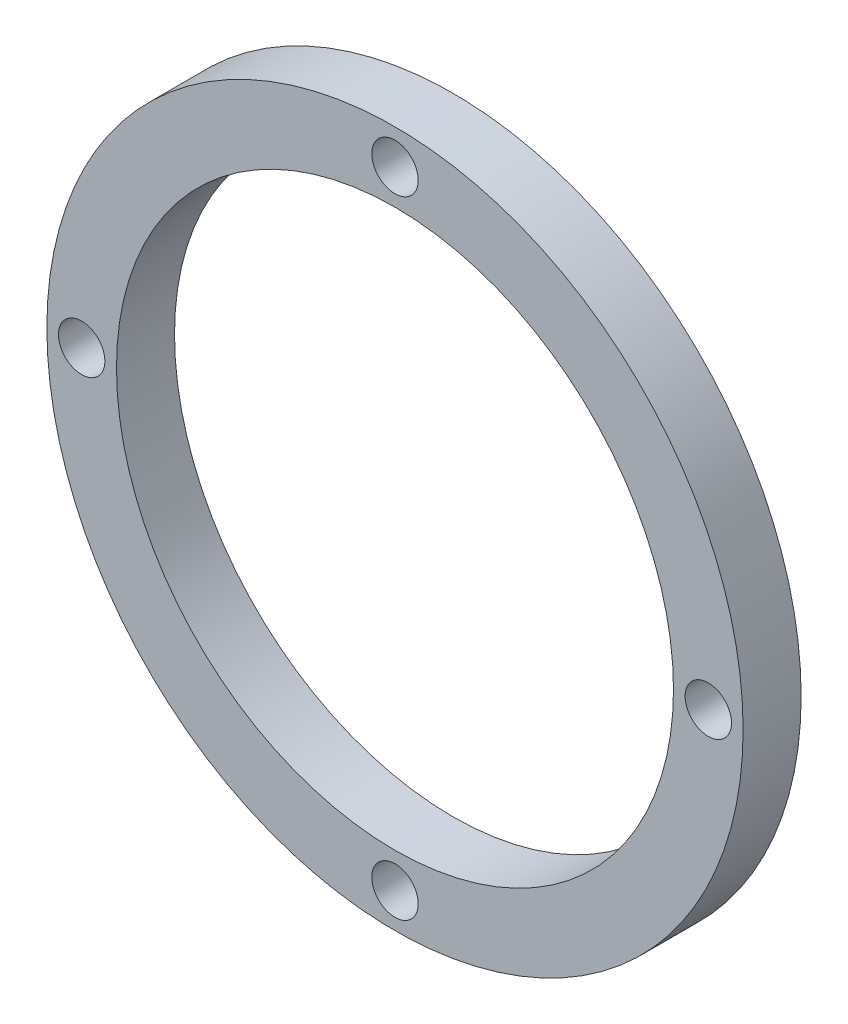
ISO-10303-21;
HEADER;
FILE_DESCRIPTION(('STEP AP214'),'2;1');
FILE_NAME('part.step','',(''),(''),'','','');
FILE_SCHEMA(('AUTOMOTIVE_DESIGN { 1 0 10303 214 1 1 1 1 }'));
ENDSEC;
DATA;
#1=APPLICATION_CONTEXT('core data for automotive mechanical design processes');
#2=APPLICATION_PROTOCOL_DEFINITION('international standard','automotive_design',2000,#1);
#3=PRODUCT_CONTEXT('',#1,'mechanical');
#4=PRODUCT('Part','Part','',(#3));
#5=PRODUCT_RELATED_PRODUCT_CATEGORY('part','',(#4));
#6=PRODUCT_DEFINITION_FORMATION('','',#4);
#7=PRODUCT_DEFINITION_CONTEXT('part definition',#1,'design');
#8=PRODUCT_DEFINITION('design','',#6,#7);
#9=PRODUCT_DEFINITION_SHAPE('','',#8);
#10=(LENGTH_UNIT() NAMED_UNIT(*) SI_UNIT(.MILLI.,.METRE.));
#11=(NAMED_UNIT(*) PLANE_ANGLE_UNIT() SI_UNIT($,.RADIAN.));
#12=(NAMED_UNIT(*) SI_UNIT($,.STERADIAN.) SOLID_ANGLE_UNIT());
#13=UNCERTAINTY_MEASURE_WITH_UNIT(LENGTH_MEASURE(1.E-05),#10,'distance_accuracy_value','');
#14=(GEOMETRIC_REPRESENTATION_CONTEXT(3) GLOBAL_UNCERTAINTY_ASSIGNED_CONTEXT((#13)) GLOBAL_UNIT_ASSIGNED_CONTEXT((#10,
#11,#12)) REPRESENTATION_CONTEXT('',''));
#15=CARTESIAN_POINT('',(0.,0.,0.));
#16=DIRECTION('',(0.,0.,1.));
#17=DIRECTION('',(1.,0.,0.));
#18=AXIS2_PLACEMENT_3D('',#15,#16,#17);
#19=CARTESIAN_POINT('',(0.,0.,0.));
#20=DIRECTION('',(0.,0.,1.));
#21=DIRECTION('',(1.,0.,0.));
#22=AXIS2_PLACEMENT_3D('',#19,#20,#21);
#23=PLANE('',#22);
#24=CARTESIAN_POINT('',(0.,0.,0.));
#25=DIRECTION('',(0.,0.,1.));
#26=DIRECTION('',(1.,0.,0.));
#27=AXIS2_PLACEMENT_3D('',#24,#25,#26);
#28=CIRCLE('',#27,15.);
#29=CARTESIAN_POINT('',(15.,0.,0.));
#30=VERTEX_POINT('',#29);
#31=EDGE_CURVE('E10',#30,#30,#28,.T.);
#32=ORIENTED_EDGE('',*,*,#31,.F.);
#33=EDGE_LOOP('',(#32));
#34=FACE_BOUND('',#33,.T.);
#35=CARTESIAN_POINT('',(0.,0.,0.));
#36=DIRECTION('',(0.,0.,1.));
#37=DIRECTION('',(1.,0.,0.));
#38=AXIS2_PLACEMENT_3D('',#35,#36,#37);
#39=CIRCLE('',#38,12.);
#40=CARTESIAN_POINT('',(12.,0.,0.));
#41=VERTEX_POINT('',#40);
#42=EDGE_CURVE('E38',#41,#41,#39,.T.);
#43=ORIENTED_EDGE('',*,*,#42,.T.);
#44=EDGE_LOOP('',(#43));
#45=FACE_BOUND('',#44,.T.);
#46=CARTESIAN_POINT('',(0.,13.5,0.));
#47=DIRECTION('',(0.,0.,1.));
#48=DIRECTION('',(1.,0.,0.));
#49=AXIS2_PLACEMENT_3D('',#46,#47,#48);
#50=CIRCLE('',#49,1.);
#51=CARTESIAN_POINT('',(1.,13.5,0.));
#52=VERTEX_POINT('',#51);
#53=EDGE_CURVE('E42',#52,#52,#50,.T.);
#54=ORIENTED_EDGE('',*,*,#53,.T.);
#55=EDGE_LOOP('',(#54));
#56=FACE_BOUND('',#55,.T.);
#57=CARTESIAN_POINT('',(13.5000000000004,3.81213167542181E-13,0.));
#58=DIRECTION('',(0.,0.,1.));
#59=DIRECTION('',(1.,0.,0.));
#60=AXIS2_PLACEMENT_3D('',#57,#58,#59);
#61=CIRCLE('',#60,1.0000000000003);
#62=CARTESIAN_POINT('',(14.5000000000007,3.81213167542181E-13,0.));
#63=VERTEX_POINT('',#62);
#64=EDGE_CURVE('E46',#63,#63,#61,.T.);
#65=ORIENTED_EDGE('',*,*,#64,.T.);
#66=EDGE_LOOP('',(#65));
#67=FACE_BOUND('',#66,.T.);
#68=CARTESIAN_POINT('',(7.62426335084362E-13,-13.5,0.));
#69=DIRECTION('',(0.,0.,1.));
#70=DIRECTION('',(1.,0.,0.));
#71=AXIS2_PLACEMENT_3D('',#68,#69,#70);
#72=CIRCLE('',#71,1.00000000000082);
#73=CARTESIAN_POINT('',(1.00000000000158,-13.5,0.));
#74=VERTEX_POINT('',#73);
#75=EDGE_CURVE('E51',#74,#74,#72,.T.);
#76=ORIENTED_EDGE('',*,*,#75,.T.);
#77=EDGE_LOOP('',(#76));
#78=FACE_BOUND('',#77,.T.);
#79=CARTESIAN_POINT('',(-13.4999999999996,-3.8286644072103E-13,0.));
#80=DIRECTION('',(0.,0.,1.));
#81=DIRECTION('',(1.,0.,0.));
#82=AXIS2_PLACEMENT_3D('',#79,#80,#81);
#83=CIRCLE('',#82,1.00000000000061);
#84=CARTESIAN_POINT('',(-12.499999999999,-3.8286644072103E-13,0.));
#85=VERTEX_POINT('',#84);
#86=EDGE_CURVE('E54',#85,#85,#83,.T.);
#87=ORIENTED_EDGE('',*,*,#86,.T.);
#88=EDGE_LOOP('',(#87));
#89=FACE_BOUND('',#88,.T.);
#90=ADVANCED_FACE('F31',(#34,#45,#56,#67,#78,#89),#23,.F.);
#91=CARTESIAN_POINT('',(0.,0.,1.));
#92=DIRECTION('',(0.,0.,-1.));
#93=DIRECTION('',(-1.,0.,0.));
#94=AXIS2_PLACEMENT_3D('',#91,#92,#93);
#95=CYLINDRICAL_SURFACE('',#94,15.);
#96=ORIENTED_EDGE('',*,*,#31,.T.);
#97=EDGE_LOOP('',(#96));
#98=FACE_BOUND('',#97,.T.);
#99=CARTESIAN_POINT('',(0.,0.,2.5));
#100=DIRECTION('',(0.,0.,1.));
#101=DIRECTION('',(1.,0.,0.));
#102=AXIS2_PLACEMENT_3D('',#99,#100,#101);
#103=CIRCLE('',#102,15.);
#104=CARTESIAN_POINT('',(15.,0.,2.5));
#105=VERTEX_POINT('',#104);
#106=EDGE_CURVE('E57',#105,#105,#103,.T.);
#107=ORIENTED_EDGE('',*,*,#106,.F.);
#108=EDGE_LOOP('',(#107));
#109=FACE_BOUND('',#108,.T.);
#110=ADVANCED_FACE('F33',(#98,#109),#95,.T.);
#111=CARTESIAN_POINT('',(0.,0.,1.));
#112=DIRECTION('',(0.,0.,-1.));
#113=DIRECTION('',(-1.,0.,0.));
#114=AXIS2_PLACEMENT_3D('',#111,#112,#113);
#115=CYLINDRICAL_SURFACE('',#114,12.);
#116=ORIENTED_EDGE('',*,*,#42,.F.);
#117=EDGE_LOOP('',(#116));
#118=FACE_BOUND('',#117,.T.);
#119=CARTESIAN_POINT('',(0.,0.,2.5));
#120=DIRECTION('',(0.,0.,1.));
#121=DIRECTION('',(1.,0.,0.));
#122=AXIS2_PLACEMENT_3D('',#119,#120,#121);
#123=CIRCLE('',#122,12.);
#124=CARTESIAN_POINT('',(12.,0.,2.5));
#125=VERTEX_POINT('',#124);
#126=EDGE_CURVE('E60',#125,#125,#123,.T.);
#127=ORIENTED_EDGE('',*,*,#126,.T.);
#128=EDGE_LOOP('',(#127));
#129=FACE_BOUND('',#128,.T.);
#130=ADVANCED_FACE('F95',(#118,#129),#115,.F.);
#131=CARTESIAN_POINT('',(0.,13.5,1.));
#132=DIRECTION('',(0.,0.,-1.));
#133=DIRECTION('',(-1.,0.,0.));
#134=AXIS2_PLACEMENT_3D('',#131,#132,#133);
#135=CYLINDRICAL_SURFACE('',#134,1.);
#136=ORIENTED_EDGE('',*,*,#53,.F.);
#137=EDGE_LOOP('',(#136));
#138=FACE_BOUND('',#137,.T.);
#139=CARTESIAN_POINT('',(0.,13.5,2.5));
#140=DIRECTION('',(0.,0.,1.));
#141=DIRECTION('',(1.,0.,0.));
#142=AXIS2_PLACEMENT_3D('',#139,#140,#141);
#143=CIRCLE('',#142,1.);
#144=CARTESIAN_POINT('',(1.,13.5,2.5));
#145=VERTEX_POINT('',#144);
#146=EDGE_CURVE('E63',#145,#145,#143,.T.);
#147=ORIENTED_EDGE('',*,*,#146,.T.);
#148=EDGE_LOOP('',(#147));
#149=FACE_BOUND('',#148,.T.);
#150=ADVANCED_FACE('F99',(#138,#149),#135,.F.);
#151=CARTESIAN_POINT('',(13.5000000000004,3.81213167542181E-13,1.));
#152=DIRECTION('',(0.,0.,-1.));
#153=DIRECTION('',(-1.,0.,0.));
#154=AXIS2_PLACEMENT_3D('',#151,#152,#153);
#155=CYLINDRICAL_SURFACE('',#154,1.0000000000003);
#156=ORIENTED_EDGE('',*,*,#64,.F.);
#157=EDGE_LOOP('',(#156));
#158=FACE_BOUND('',#157,.T.);
#159=CARTESIAN_POINT('',(13.5000000000004,3.81213167542181E-13,2.5));
#160=DIRECTION('',(0.,0.,1.));
#161=DIRECTION('',(1.,0.,0.));
#162=AXIS2_PLACEMENT_3D('',#159,#160,#161);
#163=CIRCLE('',#162,1.0000000000003);
#164=CARTESIAN_POINT('',(14.5000000000007,3.81213167542181E-13,2.5));
#165=VERTEX_POINT('',#164);
#166=EDGE_CURVE('E66',#165,#165,#163,.T.);
#167=ORIENTED_EDGE('',*,*,#166,.T.);
#168=EDGE_LOOP('',(#167));
#169=FACE_BOUND('',#168,.T.);
#170=ADVANCED_FACE('F103',(#158,#169),#155,.F.);
#171=CARTESIAN_POINT('',(7.62426335084362E-13,-13.5,1.));
#172=DIRECTION('',(0.,0.,-1.));
#173=DIRECTION('',(-1.,0.,0.));
#174=AXIS2_PLACEMENT_3D('',#171,#172,#173);
#175=CYLINDRICAL_SURFACE('',#174,1.00000000000082);
#176=ORIENTED_EDGE('',*,*,#75,.F.);
#177=EDGE_LOOP('',(#176));
#178=FACE_BOUND('',#177,.T.);
#179=CARTESIAN_POINT('',(7.62426335084362E-13,-13.5,2.5));
#180=DIRECTION('',(0.,0.,1.));
#181=DIRECTION('',(1.,0.,0.));
#182=AXIS2_PLACEMENT_3D('',#179,#180,#181);
#183=CIRCLE('',#182,1.00000000000082);
#184=CARTESIAN_POINT('',(1.00000000000158,-13.5,2.5));
#185=VERTEX_POINT('',#184);
#186=EDGE_CURVE('E69',#185,#185,#183,.T.);
#187=ORIENTED_EDGE('',*,*,#186,.T.);
#188=EDGE_LOOP('',(#187));
#189=FACE_BOUND('',#188,.T.);
#190=ADVANCED_FACE('F85',(#178,#189),#175,.F.);
#191=CARTESIAN_POINT('',(-13.4999999999996,-3.8286644072103E-13,1.));
#192=DIRECTION('',(0.,0.,-1.));
#193=DIRECTION('',(-1.,0.,0.));
#194=AXIS2_PLACEMENT_3D('',#191,#192,#193);
#195=CYLINDRICAL_SURFACE('',#194,1.00000000000061);
#196=ORIENTED_EDGE('',*,*,#86,.F.);
#197=EDGE_LOOP('',(#196));
#198=FACE_BOUND('',#197,.T.);
#199=CARTESIAN_POINT('',(-13.4999999999996,-3.8286644072103E-13,2.5));
#200=DIRECTION('',(0.,0.,1.));
#201=DIRECTION('',(1.,0.,0.));
#202=AXIS2_PLACEMENT_3D('',#199,#200,#201);
#203=CIRCLE('',#202,1.00000000000061);
#204=CARTESIAN_POINT('',(-12.499999999999,-3.8286644072103E-13,2.5));
#205=VERTEX_POINT('',#204);
#206=EDGE_CURVE('E72',#205,#205,#203,.T.);
#207=ORIENTED_EDGE('',*,*,#206,.T.);
#208=EDGE_LOOP('',(#207));
#209=FACE_BOUND('',#208,.T.);
#210=ADVANCED_FACE('F76',(#198,#209),#195,.F.);
#211=CARTESIAN_POINT('',(0.,0.,2.5));
#212=DIRECTION('',(0.,0.,1.));
#213=DIRECTION('',(1.,0.,0.));
#214=AXIS2_PLACEMENT_3D('',#211,#212,#213);
#215=PLANE('',#214);
#216=ORIENTED_EDGE('',*,*,#186,.F.);
#217=EDGE_LOOP('',(#216));
#218=FACE_BOUND('',#217,.T.);
#219=ORIENTED_EDGE('',*,*,#146,.F.);
#220=EDGE_LOOP('',(#219));
#221=FACE_BOUND('',#220,.T.);
#222=ORIENTED_EDGE('',*,*,#106,.T.);
#223=EDGE_LOOP('',(#222));
#224=FACE_BOUND('',#223,.T.);
#225=ORIENTED_EDGE('',*,*,#126,.F.);
#226=EDGE_LOOP('',(#225));
#227=FACE_BOUND('',#226,.T.);
#228=ORIENTED_EDGE('',*,*,#166,.F.);
#229=EDGE_LOOP('',(#228));
#230=FACE_BOUND('',#229,.T.);
#231=ORIENTED_EDGE('',*,*,#206,.F.);
#232=EDGE_LOOP('',(#231));
#233=FACE_BOUND('',#232,.T.);
#234=ADVANCED_FACE('F78',(#218,#221,#224,#227,#230,#233),#215,.T.);
#235=CLOSED_SHELL('',(#90,#110,#130,#150,#170,#190,#210,#234));
#236=MANIFOLD_SOLID_BREP('B2',#235);
#237=ADVANCED_BREP_SHAPE_REPRESENTATION('',(#18,#236),#14);
#238=SHAPE_DEFINITION_REPRESENTATION(#9,#237);
ENDSEC;
END-ISO-10303-21;
